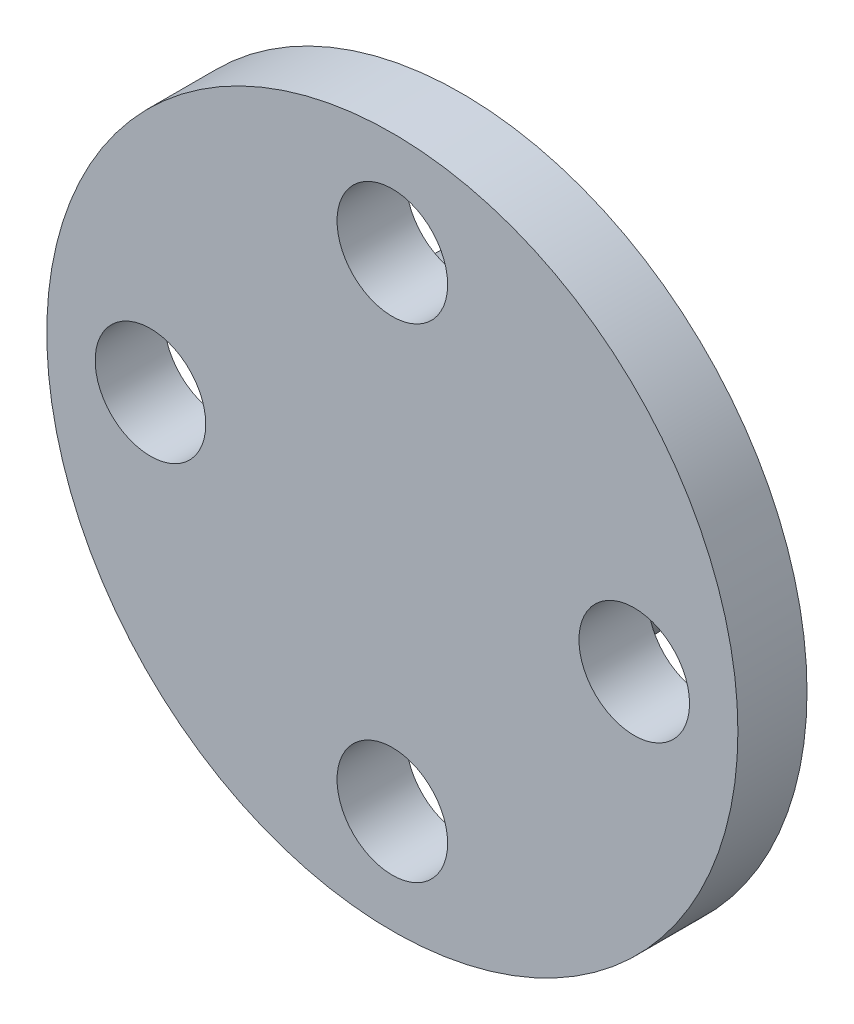
ISO-10303-21;
HEADER;
FILE_DESCRIPTION(('STEP AP214'),'2;1');
FILE_NAME('part.step','',(''),(''),'','','');
FILE_SCHEMA(('AUTOMOTIVE_DESIGN { 1 0 10303 214 1 1 1 1 }'));
ENDSEC;
DATA;
#1=APPLICATION_CONTEXT('core data for automotive mechanical design processes');
#2=APPLICATION_PROTOCOL_DEFINITION('international standard','automotive_design',2000,#1);
#3=PRODUCT_CONTEXT('',#1,'mechanical');
#4=PRODUCT('Part','Part','',(#3));
#5=PRODUCT_RELATED_PRODUCT_CATEGORY('part','',(#4));
#6=PRODUCT_DEFINITION_FORMATION('','',#4);
#7=PRODUCT_DEFINITION_CONTEXT('part definition',#1,'design');
#8=PRODUCT_DEFINITION('design','',#6,#7);
#9=PRODUCT_DEFINITION_SHAPE('','',#8);
#10=(LENGTH_UNIT() NAMED_UNIT(*) SI_UNIT(.MILLI.,.METRE.));
#11=(NAMED_UNIT(*) PLANE_ANGLE_UNIT() SI_UNIT($,.RADIAN.));
#12=(NAMED_UNIT(*) SI_UNIT($,.STERADIAN.) SOLID_ANGLE_UNIT());
#13=UNCERTAINTY_MEASURE_WITH_UNIT(LENGTH_MEASURE(1.E-05),#10,'distance_accuracy_value','');
#14=(GEOMETRIC_REPRESENTATION_CONTEXT(3) GLOBAL_UNCERTAINTY_ASSIGNED_CONTEXT((#13)) GLOBAL_UNIT_ASSIGNED_CONTEXT((#10,
#11,#12)) REPRESENTATION_CONTEXT('',''));
#15=CARTESIAN_POINT('',(0.,0.,0.));
#16=DIRECTION('',(0.,0.,1.));
#17=DIRECTION('',(1.,0.,0.));
#18=AXIS2_PLACEMENT_3D('',#15,#16,#17);
#19=CARTESIAN_POINT('',(0.,0.,2.));
#20=DIRECTION('',(0.,0.,1.));
#21=DIRECTION('',(1.,0.,0.));
#22=AXIS2_PLACEMENT_3D('',#19,#20,#21);
#23=PLANE('',#22);
#24=CARTESIAN_POINT('',(1.96380207734619E-13,-7.,2.));
#25=DIRECTION('',(0.,0.,1.));
#26=DIRECTION('',(1.,0.,0.));
#27=AXIS2_PLACEMENT_3D('',#24,#25,#26);
#28=CIRCLE('',#27,1.60000000000023);
#29=CARTESIAN_POINT('',(1.60000000000043,-7.,2.));
#30=VERTEX_POINT('',#29);
#31=EDGE_CURVE('E70',#30,#30,#28,.T.);
#32=ORIENTED_EDGE('',*,*,#31,.F.);
#33=EDGE_LOOP('',(#32));
#34=FACE_BOUND('',#33,.T.);
#35=CARTESIAN_POINT('',(0.,7.,2.));
#36=DIRECTION('',(0.,0.,1.));
#37=DIRECTION('',(1.,0.,0.));
#38=AXIS2_PLACEMENT_3D('',#35,#36,#37);
#39=CIRCLE('',#38,1.6);
#40=CARTESIAN_POINT('',(1.6,7.,2.));
#41=VERTEX_POINT('',#40);
#42=EDGE_CURVE('E56',#41,#41,#39,.T.);
#43=ORIENTED_EDGE('',*,*,#42,.F.);
#44=EDGE_LOOP('',(#43));
#45=FACE_BOUND('',#44,.T.);
#46=CARTESIAN_POINT('',(0.,0.,2.));
#47=DIRECTION('',(0.,0.,1.));
#48=DIRECTION('',(1.,0.,0.));
#49=AXIS2_PLACEMENT_3D('',#46,#47,#48);
#50=CIRCLE('',#49,10.);
#51=CARTESIAN_POINT('',(10.,0.,2.));
#52=VERTEX_POINT('',#51);
#53=EDGE_CURVE('E45',#52,#52,#50,.T.);
#54=ORIENTED_EDGE('',*,*,#53,.T.);
#55=EDGE_LOOP('',(#54));
#56=FACE_BOUND('',#55,.T.);
#57=CARTESIAN_POINT('',(7.,0.,2.));
#58=DIRECTION('',(0.,0.,1.));
#59=DIRECTION('',(1.,0.,0.));
#60=AXIS2_PLACEMENT_3D('',#57,#58,#59);
#61=CIRCLE('',#60,1.6);
#62=CARTESIAN_POINT('',(8.6,0.,2.));
#63=VERTEX_POINT('',#62);
#64=EDGE_CURVE('E62',#63,#63,#61,.T.);
#65=ORIENTED_EDGE('',*,*,#64,.F.);
#66=EDGE_LOOP('',(#65));
#67=FACE_BOUND('',#66,.T.);
#68=CARTESIAN_POINT('',(-7.,0.,2.));
#69=DIRECTION('',(0.,0.,1.));
#70=DIRECTION('',(1.,0.,0.));
#71=AXIS2_PLACEMENT_3D('',#68,#69,#70);
#72=CIRCLE('',#71,1.6);
#73=CARTESIAN_POINT('',(-5.4,0.,2.));
#74=VERTEX_POINT('',#73);
#75=EDGE_CURVE('E78',#74,#74,#72,.T.);
#76=ORIENTED_EDGE('',*,*,#75,.F.);
#77=EDGE_LOOP('',(#76));
#78=FACE_BOUND('',#77,.T.);
#79=ADVANCED_FACE('F37',(#34,#45,#56,#67,#78),#23,.T.);
#80=CARTESIAN_POINT('',(0.,0.,0.));
#81=DIRECTION('',(0.,0.,1.));
#82=DIRECTION('',(1.,0.,0.));
#83=AXIS2_PLACEMENT_3D('',#80,#81,#82);
#84=PLANE('',#83);
#85=CARTESIAN_POINT('',(0.,0.,0.));
#86=DIRECTION('',(0.,0.,1.));
#87=DIRECTION('',(1.,0.,0.));
#88=AXIS2_PLACEMENT_3D('',#85,#86,#87);
#89=CIRCLE('',#88,4.5);
#90=CARTESIAN_POINT('',(4.5,0.,0.));
#91=VERTEX_POINT('',#90);
#92=EDGE_CURVE('E10',#91,#91,#89,.F.);
#93=ORIENTED_EDGE('',*,*,#92,.F.);
#94=EDGE_LOOP('',(#93));
#95=FACE_BOUND('',#94,.T.);
#96=CARTESIAN_POINT('',(0.,0.,0.));
#97=DIRECTION('',(0.,0.,1.));
#98=DIRECTION('',(1.,0.,0.));
#99=AXIS2_PLACEMENT_3D('',#96,#97,#98);
#100=CIRCLE('',#99,10.);
#101=CARTESIAN_POINT('',(10.,0.,0.));
#102=VERTEX_POINT('',#101);
#103=EDGE_CURVE('E50',#102,#102,#100,.T.);
#104=ORIENTED_EDGE('',*,*,#103,.F.);
#105=EDGE_LOOP('',(#104));
#106=FACE_BOUND('',#105,.T.);
#107=CARTESIAN_POINT('',(0.,7.,0.));
#108=DIRECTION('',(0.,0.,1.));
#109=DIRECTION('',(1.,0.,0.));
#110=AXIS2_PLACEMENT_3D('',#107,#108,#109);
#111=CIRCLE('',#110,1.6);
#112=CARTESIAN_POINT('',(1.6,7.,0.));
#113=VERTEX_POINT('',#112);
#114=EDGE_CURVE('E58',#113,#113,#111,.T.);
#115=ORIENTED_EDGE('',*,*,#114,.T.);
#116=EDGE_LOOP('',(#115));
#117=FACE_BOUND('',#116,.T.);
#118=CARTESIAN_POINT('',(7.,0.,0.));
#119=DIRECTION('',(0.,0.,1.));
#120=DIRECTION('',(1.,0.,0.));
#121=AXIS2_PLACEMENT_3D('',#118,#119,#120);
#122=CIRCLE('',#121,1.6);
#123=CARTESIAN_POINT('',(8.6,0.,0.));
#124=VERTEX_POINT('',#123);
#125=EDGE_CURVE('E66',#124,#124,#122,.T.);
#126=ORIENTED_EDGE('',*,*,#125,.T.);
#127=EDGE_LOOP('',(#126));
#128=FACE_BOUND('',#127,.T.);
#129=CARTESIAN_POINT('',(1.96380207734619E-13,-7.,0.));
#130=DIRECTION('',(0.,0.,1.));
#131=DIRECTION('',(1.,0.,0.));
#132=AXIS2_PLACEMENT_3D('',#129,#130,#131);
#133=CIRCLE('',#132,1.60000000000023);
#134=CARTESIAN_POINT('',(1.60000000000043,-7.,0.));
#135=VERTEX_POINT('',#134);
#136=EDGE_CURVE('E74',#135,#135,#133,.T.);
#137=ORIENTED_EDGE('',*,*,#136,.T.);
#138=EDGE_LOOP('',(#137));
#139=FACE_BOUND('',#138,.T.);
#140=CARTESIAN_POINT('',(-7.,0.,0.));
#141=DIRECTION('',(0.,0.,1.));
#142=DIRECTION('',(1.,0.,0.));
#143=AXIS2_PLACEMENT_3D('',#140,#141,#142);
#144=CIRCLE('',#143,1.6);
#145=CARTESIAN_POINT('',(-5.4,0.,0.));
#146=VERTEX_POINT('',#145);
#147=EDGE_CURVE('E82',#146,#146,#144,.T.);
#148=ORIENTED_EDGE('',*,*,#147,.T.);
#149=EDGE_LOOP('',(#148));
#150=FACE_BOUND('',#149,.T.);
#151=ADVANCED_FACE('F122',(#95,#106,#117,#128,#139,#150),#84,.F.);
#152=CARTESIAN_POINT('',(0.,0.,2.));
#153=DIRECTION('',(0.,0.,-1.));
#154=DIRECTION('',(-1.,0.,0.));
#155=AXIS2_PLACEMENT_3D('',#152,#153,#154);
#156=CYLINDRICAL_SURFACE('',#155,10.);
#157=ORIENTED_EDGE('',*,*,#53,.F.);
#158=EDGE_LOOP('',(#157));
#159=FACE_BOUND('',#158,.T.);
#160=ORIENTED_EDGE('',*,*,#103,.T.);
#161=EDGE_LOOP('',(#160));
#162=FACE_BOUND('',#161,.T.);
#163=ADVANCED_FACE('F39',(#159,#162),#156,.T.);
#164=CARTESIAN_POINT('',(0.,7.,2.));
#165=DIRECTION('',(0.,0.,-1.));
#166=DIRECTION('',(-1.,0.,0.));
#167=AXIS2_PLACEMENT_3D('',#164,#165,#166);
#168=CYLINDRICAL_SURFACE('',#167,1.6);
#169=ORIENTED_EDGE('',*,*,#42,.T.);
#170=EDGE_LOOP('',(#169));
#171=FACE_BOUND('',#170,.T.);
#172=ORIENTED_EDGE('',*,*,#114,.F.);
#173=EDGE_LOOP('',(#172));
#174=FACE_BOUND('',#173,.T.);
#175=ADVANCED_FACE('F133',(#171,#174),#168,.F.);
#176=CARTESIAN_POINT('',(7.,0.,2.));
#177=DIRECTION('',(0.,0.,-1.));
#178=DIRECTION('',(-1.,0.,0.));
#179=AXIS2_PLACEMENT_3D('',#176,#177,#178);
#180=CYLINDRICAL_SURFACE('',#179,1.6);
#181=ORIENTED_EDGE('',*,*,#64,.T.);
#182=EDGE_LOOP('',(#181));
#183=FACE_BOUND('',#182,.T.);
#184=ORIENTED_EDGE('',*,*,#125,.F.);
#185=EDGE_LOOP('',(#184));
#186=FACE_BOUND('',#185,.T.);
#187=ADVANCED_FACE('F136',(#183,#186),#180,.F.);
#188=CARTESIAN_POINT('',(1.96380207734619E-13,-7.,2.));
#189=DIRECTION('',(0.,0.,-1.));
#190=DIRECTION('',(-1.,0.,0.));
#191=AXIS2_PLACEMENT_3D('',#188,#189,#190);
#192=CYLINDRICAL_SURFACE('',#191,1.60000000000023);
#193=ORIENTED_EDGE('',*,*,#31,.T.);
#194=EDGE_LOOP('',(#193));
#195=FACE_BOUND('',#194,.T.);
#196=ORIENTED_EDGE('',*,*,#136,.F.);
#197=EDGE_LOOP('',(#196));
#198=FACE_BOUND('',#197,.T.);
#199=ADVANCED_FACE('F117',(#195,#198),#192,.F.);
#200=CARTESIAN_POINT('',(-7.,0.,2.));
#201=DIRECTION('',(0.,0.,-1.));
#202=DIRECTION('',(-1.,0.,0.));
#203=AXIS2_PLACEMENT_3D('',#200,#201,#202);
#204=CYLINDRICAL_SURFACE('',#203,1.6);
#205=ORIENTED_EDGE('',*,*,#75,.T.);
#206=EDGE_LOOP('',(#205));
#207=FACE_BOUND('',#206,.T.);
#208=ORIENTED_EDGE('',*,*,#147,.F.);
#209=EDGE_LOOP('',(#208));
#210=FACE_BOUND('',#209,.T.);
#211=ADVANCED_FACE('F108',(#207,#210),#204,.F.);
#212=CARTESIAN_POINT('',(0.,0.,-2.5));
#213=DIRECTION('',(0.,0.,-1.));
#214=DIRECTION('',(-1.,0.,0.));
#215=AXIS2_PLACEMENT_3D('',#212,#213,#214);
#216=PLANE('',#215);
#217=CARTESIAN_POINT('',(0.,0.,-2.5));
#218=DIRECTION('',(0.,0.,-1.));
#219=DIRECTION('',(-1.,0.,0.));
#220=AXIS2_PLACEMENT_3D('',#217,#218,#219);
#221=CIRCLE('',#220,4.5);
#222=CARTESIAN_POINT('',(-4.5,0.,-2.5));
#223=VERTEX_POINT('',#222);
#224=EDGE_CURVE('E86',#223,#223,#221,.T.);
#225=ORIENTED_EDGE('',*,*,#224,.T.);
#226=EDGE_LOOP('',(#225));
#227=FACE_BOUND('',#226,.T.);
#228=CARTESIAN_POINT('',(0.,0.,-2.5));
#229=DIRECTION('',(0.,0.,-1.));
#230=DIRECTION('',(-1.,0.,0.));
#231=AXIS2_PLACEMENT_3D('',#228,#229,#230);
#232=CIRCLE('',#231,2.75);
#233=CARTESIAN_POINT('',(-2.75,0.,-2.5));
#234=VERTEX_POINT('',#233);
#235=EDGE_CURVE('E93',#234,#234,#232,.T.);
#236=ORIENTED_EDGE('',*,*,#235,.F.);
#237=EDGE_LOOP('',(#236));
#238=FACE_BOUND('',#237,.T.);
#239=ADVANCED_FACE('F105',(#227,#238),#216,.T.);
#240=CARTESIAN_POINT('',(0.,0.,-2.5));
#241=DIRECTION('',(0.,0.,1.));
#242=DIRECTION('',(1.,0.,0.));
#243=AXIS2_PLACEMENT_3D('',#240,#241,#242);
#244=CYLINDRICAL_SURFACE('',#243,4.5);
#245=ORIENTED_EDGE('',*,*,#224,.F.);
#246=EDGE_LOOP('',(#245));
#247=FACE_BOUND('',#246,.T.);
#248=ORIENTED_EDGE('',*,*,#92,.T.);
#249=EDGE_LOOP('',(#248));
#250=FACE_BOUND('',#249,.T.);
#251=ADVANCED_FACE('F107',(#247,#250),#244,.T.);
#252=CARTESIAN_POINT('',(0.,0.,-2.5));
#253=DIRECTION('',(0.,0.,1.));
#254=DIRECTION('',(1.,0.,0.));
#255=AXIS2_PLACEMENT_3D('',#252,#253,#254);
#256=CYLINDRICAL_SURFACE('',#255,2.75);
#257=ORIENTED_EDGE('',*,*,#235,.T.);
#258=EDGE_LOOP('',(#257));
#259=FACE_BOUND('',#258,.T.);
#260=CARTESIAN_POINT('',(0.,0.,0.));
#261=DIRECTION('',(0.,0.,-1.));
#262=DIRECTION('',(-1.,0.,0.));
#263=AXIS2_PLACEMENT_3D('',#260,#261,#262);
#264=CIRCLE('',#263,2.75);
#265=CARTESIAN_POINT('',(-2.75,0.,0.));
#266=VERTEX_POINT('',#265);
#267=EDGE_CURVE('E94',#266,#266,#264,.T.);
#268=ORIENTED_EDGE('',*,*,#267,.F.);
#269=EDGE_LOOP('',(#268));
#270=FACE_BOUND('',#269,.T.);
#271=ADVANCED_FACE('F102',(#259,#270),#256,.F.);
#272=ORIENTED_EDGE('',*,*,#267,.T.);
#273=EDGE_LOOP('',(#272));
#274=FACE_BOUND('',#273,.T.);
#275=ADVANCED_FACE('F129',(#274),#84,.F.);
#276=CLOSED_SHELL('',(#79,#151,#163,#175,#187,#199,#211,#239,#251,#271,#275));
#277=MANIFOLD_SOLID_BREP('B2',#276);
#278=ADVANCED_BREP_SHAPE_REPRESENTATION('',(#18,#277),#14);
#279=SHAPE_DEFINITION_REPRESENTATION(#9,#278);
ENDSEC;
END-ISO-10303-21;
